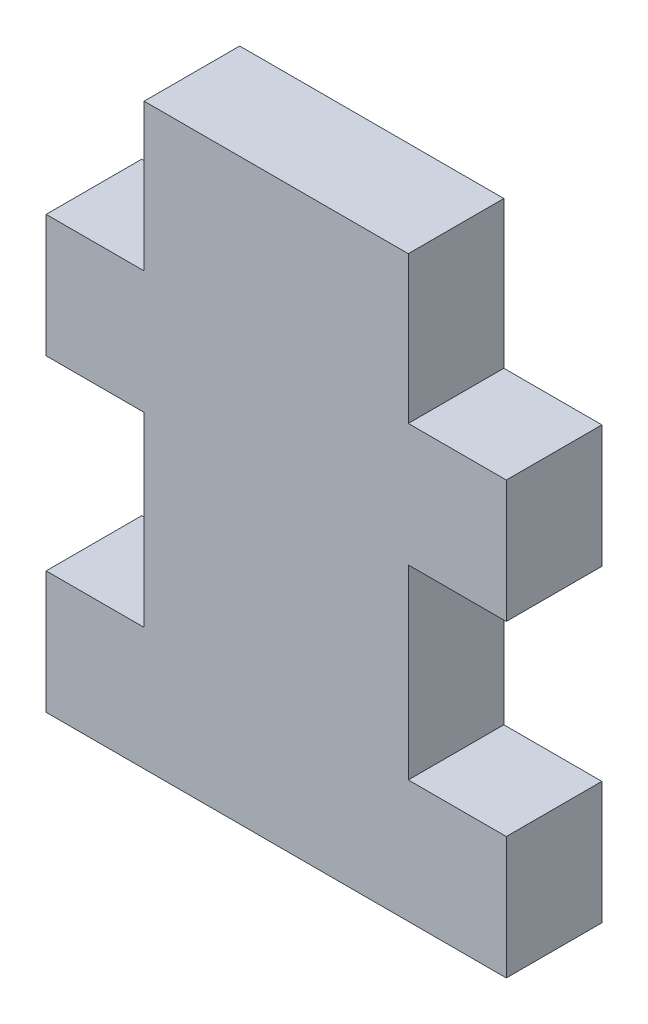
ISO-10303-21;
HEADER;
FILE_DESCRIPTION(('STEP AP214'),'2;1');
FILE_NAME('part.step','',(''),(''),'','','');
FILE_SCHEMA(('AUTOMOTIVE_DESIGN { 1 0 10303 214 1 1 1 1 }'));
ENDSEC;
DATA;
#1=APPLICATION_CONTEXT('core data for automotive mechanical design processes');
#2=APPLICATION_PROTOCOL_DEFINITION('international standard','automotive_design',2000,#1);
#3=PRODUCT_CONTEXT('',#1,'mechanical');
#4=PRODUCT('Part','Part','',(#3));
#5=PRODUCT_RELATED_PRODUCT_CATEGORY('part','',(#4));
#6=PRODUCT_DEFINITION_FORMATION('','',#4);
#7=PRODUCT_DEFINITION_CONTEXT('part definition',#1,'design');
#8=PRODUCT_DEFINITION('design','',#6,#7);
#9=PRODUCT_DEFINITION_SHAPE('','',#8);
#10=(LENGTH_UNIT() NAMED_UNIT(*) SI_UNIT(.MILLI.,.METRE.));
#11=(NAMED_UNIT(*) PLANE_ANGLE_UNIT() SI_UNIT($,.RADIAN.));
#12=(NAMED_UNIT(*) SI_UNIT($,.STERADIAN.) SOLID_ANGLE_UNIT());
#13=UNCERTAINTY_MEASURE_WITH_UNIT(LENGTH_MEASURE(1.E-05),#10,'distance_accuracy_value','');
#14=(GEOMETRIC_REPRESENTATION_CONTEXT(3) GLOBAL_UNCERTAINTY_ASSIGNED_CONTEXT((#13)) GLOBAL_UNIT_ASSIGNED_CONTEXT((#10,
#11,#12)) REPRESENTATION_CONTEXT('',''));
#15=CARTESIAN_POINT('',(0.,0.,0.));
#16=DIRECTION('',(0.,0.,1.));
#17=DIRECTION('',(1.,0.,0.));
#18=AXIS2_PLACEMENT_3D('',#15,#16,#17);
#19=CARTESIAN_POINT('',(6.84529999999999,76.835,2.4765));
#20=DIRECTION('',(-1.,0.,0.));
#21=DIRECTION('',(0.,-1.,0.));
#22=AXIS2_PLACEMENT_3D('',#19,#20,#21);
#23=PLANE('',#22);
#24=DIRECTION('',(0.,1.,0.));
#25=VECTOR('',#24,1.);
#26=CARTESIAN_POINT('',(6.84529999999999,76.835,-2.4765));
#27=LINE('',#26,#25);
#28=CARTESIAN_POINT('',(6.84529999999999,76.835,-2.4765));
#29=VERTEX_POINT('',#28);
#30=CARTESIAN_POINT('',(6.84529999999999,84.455,-2.4765));
#31=VERTEX_POINT('',#30);
#32=EDGE_CURVE('E177',#29,#31,#27,.T.);
#33=ORIENTED_EDGE('',*,*,#32,.T.);
#34=DIRECTION('',(0.,0.,-1.));
#35=VECTOR('',#34,1.);
#36=CARTESIAN_POINT('',(6.84529999999999,84.455,2.4765));
#37=LINE('',#36,#35);
#38=CARTESIAN_POINT('',(6.84529999999999,84.455,2.4765));
#39=VERTEX_POINT('',#38);
#40=EDGE_CURVE('E11',#39,#31,#37,.T.);
#41=ORIENTED_EDGE('',*,*,#40,.F.);
#42=DIRECTION('',(0.,1.,0.));
#43=VECTOR('',#42,1.);
#44=CARTESIAN_POINT('',(6.84529999999999,76.835,2.4765));
#45=LINE('',#44,#43);
#46=CARTESIAN_POINT('',(6.84529999999999,76.835,2.4765));
#47=VERTEX_POINT('',#46);
#48=EDGE_CURVE('E207',#47,#39,#45,.T.);
#49=ORIENTED_EDGE('',*,*,#48,.F.);
#50=DIRECTION('',(0.,0.,-1.));
#51=VECTOR('',#50,1.);
#52=CARTESIAN_POINT('',(6.84529999999999,76.835,2.4765));
#53=LINE('',#52,#51);
#54=EDGE_CURVE('E173',#47,#29,#53,.T.);
#55=ORIENTED_EDGE('',*,*,#54,.T.);
#56=EDGE_LOOP('',(#33,#41,#49,#55));
#57=FACE_BOUND('',#56,.T.);
#58=ADVANCED_FACE('F33',(#57),#23,.F.);
#59=CARTESIAN_POINT('',(6.84529999999999,84.455,2.4765));
#60=DIRECTION('',(0.,-1.,0.));
#61=DIRECTION('',(0.,0.,-1.));
#62=AXIS2_PLACEMENT_3D('',#59,#60,#61);
#63=PLANE('',#62);
#64=DIRECTION('',(-1.,0.,0.));
#65=VECTOR('',#64,1.);
#66=CARTESIAN_POINT('',(6.84529999999999,84.455,-2.4765));
#67=LINE('',#66,#65);
#68=CARTESIAN_POINT('',(-6.84530000000001,84.455,-2.4765));
#69=VERTEX_POINT('',#68);
#70=EDGE_CURVE('E180',#31,#69,#67,.T.);
#71=ORIENTED_EDGE('',*,*,#70,.T.);
#72=DIRECTION('',(0.,0.,-1.));
#73=VECTOR('',#72,1.);
#74=CARTESIAN_POINT('',(-6.84530000000001,84.455,2.4765));
#75=LINE('',#74,#73);
#76=CARTESIAN_POINT('',(-6.84530000000001,84.455,2.4765));
#77=VERTEX_POINT('',#76);
#78=EDGE_CURVE('E41',#77,#69,#75,.T.);
#79=ORIENTED_EDGE('',*,*,#78,.F.);
#80=DIRECTION('',(-1.,0.,0.));
#81=VECTOR('',#80,1.);
#82=CARTESIAN_POINT('',(6.84529999999999,84.455,2.4765));
#83=LINE('',#82,#81);
#84=EDGE_CURVE('E116',#39,#77,#83,.T.);
#85=ORIENTED_EDGE('',*,*,#84,.F.);
#86=ORIENTED_EDGE('',*,*,#40,.T.);
#87=EDGE_LOOP('',(#71,#79,#85,#86));
#88=FACE_BOUND('',#87,.T.);
#89=ADVANCED_FACE('F305',(#88),#63,.F.);
#90=CARTESIAN_POINT('',(-6.84530000000001,76.835,2.4765));
#91=DIRECTION('',(1.,0.,0.));
#92=DIRECTION('',(0.,1.,0.));
#93=AXIS2_PLACEMENT_3D('',#90,#91,#92);
#94=PLANE('',#93);
#95=DIRECTION('',(0.,-1.,0.));
#96=VECTOR('',#95,1.);
#97=CARTESIAN_POINT('',(-6.84530000000001,76.835,-2.4765));
#98=LINE('',#97,#96);
#99=CARTESIAN_POINT('',(-6.84530000000001,76.835,-2.4765));
#100=VERTEX_POINT('',#99);
#101=EDGE_CURVE('E182',#69,#100,#98,.T.);
#102=ORIENTED_EDGE('',*,*,#101,.T.);
#103=DIRECTION('',(0.,0.,-1.));
#104=VECTOR('',#103,1.);
#105=CARTESIAN_POINT('',(-6.84530000000001,76.835,2.4765));
#106=LINE('',#105,#104);
#107=CARTESIAN_POINT('',(-6.84530000000001,76.835,2.4765));
#108=VERTEX_POINT('',#107);
#109=EDGE_CURVE('E238',#108,#100,#106,.T.);
#110=ORIENTED_EDGE('',*,*,#109,.F.);
#111=DIRECTION('',(0.,-1.,0.));
#112=VECTOR('',#111,1.);
#113=CARTESIAN_POINT('',(-6.84530000000001,76.835,2.4765));
#114=LINE('',#113,#112);
#115=EDGE_CURVE('E246',#77,#108,#114,.T.);
#116=ORIENTED_EDGE('',*,*,#115,.F.);
#117=ORIENTED_EDGE('',*,*,#78,.T.);
#118=EDGE_LOOP('',(#102,#110,#116,#117));
#119=FACE_BOUND('',#118,.T.);
#120=ADVANCED_FACE('F244',(#119),#94,.F.);
#121=CARTESIAN_POINT('',(-6.84530000000001,76.835,2.4765));
#122=DIRECTION('',(0.,-1.,0.));
#123=DIRECTION('',(0.,0.,-1.));
#124=AXIS2_PLACEMENT_3D('',#121,#122,#123);
#125=PLANE('',#124);
#126=DIRECTION('',(-1.,0.,0.));
#127=VECTOR('',#126,1.);
#128=CARTESIAN_POINT('',(-6.84530000000001,76.835,-2.4765));
#129=LINE('',#128,#127);
#130=CARTESIAN_POINT('',(-11.9253,76.835,-2.4765));
#131=VERTEX_POINT('',#130);
#132=EDGE_CURVE('E184',#100,#131,#129,.T.);
#133=ORIENTED_EDGE('',*,*,#132,.T.);
#134=DIRECTION('',(0.,0.,-1.));
#135=VECTOR('',#134,1.);
#136=CARTESIAN_POINT('',(-11.9253,76.835,2.4765));
#137=LINE('',#136,#135);
#138=CARTESIAN_POINT('',(-11.9253,76.835,2.4765));
#139=VERTEX_POINT('',#138);
#140=EDGE_CURVE('E235',#139,#131,#137,.T.);
#141=ORIENTED_EDGE('',*,*,#140,.F.);
#142=DIRECTION('',(-1.,0.,0.));
#143=VECTOR('',#142,1.);
#144=CARTESIAN_POINT('',(-6.84530000000001,76.835,2.4765));
#145=LINE('',#144,#143);
#146=EDGE_CURVE('E264',#108,#139,#145,.T.);
#147=ORIENTED_EDGE('',*,*,#146,.F.);
#148=ORIENTED_EDGE('',*,*,#109,.T.);
#149=EDGE_LOOP('',(#133,#141,#147,#148));
#150=FACE_BOUND('',#149,.T.);
#151=ADVANCED_FACE('F255',(#150),#125,.F.);
#152=CARTESIAN_POINT('',(-11.9253,76.835,2.4765));
#153=DIRECTION('',(1.,0.,0.));
#154=DIRECTION('',(0.,1.,0.));
#155=AXIS2_PLACEMENT_3D('',#152,#153,#154);
#156=PLANE('',#155);
#157=DIRECTION('',(0.,-1.,0.));
#158=VECTOR('',#157,1.);
#159=CARTESIAN_POINT('',(-11.9253,76.835,-2.4765));
#160=LINE('',#159,#158);
#161=CARTESIAN_POINT('',(-11.9253,70.485,-2.4765));
#162=VERTEX_POINT('',#161);
#163=EDGE_CURVE('E186',#131,#162,#160,.T.);
#164=ORIENTED_EDGE('',*,*,#163,.T.);
#165=DIRECTION('',(0.,0.,-1.));
#166=VECTOR('',#165,1.);
#167=CARTESIAN_POINT('',(-11.9253,70.485,2.4765));
#168=LINE('',#167,#166);
#169=CARTESIAN_POINT('',(-11.9253,70.485,2.4765));
#170=VERTEX_POINT('',#169);
#171=EDGE_CURVE('E232',#170,#162,#168,.T.);
#172=ORIENTED_EDGE('',*,*,#171,.F.);
#173=DIRECTION('',(0.,-1.,0.));
#174=VECTOR('',#173,1.);
#175=CARTESIAN_POINT('',(-11.9253,76.835,2.4765));
#176=LINE('',#175,#174);
#177=EDGE_CURVE('E261',#139,#170,#176,.T.);
#178=ORIENTED_EDGE('',*,*,#177,.F.);
#179=ORIENTED_EDGE('',*,*,#140,.T.);
#180=EDGE_LOOP('',(#164,#172,#178,#179));
#181=FACE_BOUND('',#180,.T.);
#182=ADVANCED_FACE('F259',(#181),#156,.F.);
#183=CARTESIAN_POINT('',(-6.84530000000001,70.485,2.4765));
#184=DIRECTION('',(0.,1.,0.));
#185=DIRECTION('',(0.,0.,1.));
#186=AXIS2_PLACEMENT_3D('',#183,#184,#185);
#187=PLANE('',#186);
#188=DIRECTION('',(1.,0.,0.));
#189=VECTOR('',#188,1.);
#190=CARTESIAN_POINT('',(-6.84530000000001,70.485,-2.4765));
#191=LINE('',#190,#189);
#192=CARTESIAN_POINT('',(-6.84530000000001,70.485,-2.4765));
#193=VERTEX_POINT('',#192);
#194=EDGE_CURVE('E188',#162,#193,#191,.T.);
#195=ORIENTED_EDGE('',*,*,#194,.T.);
#196=DIRECTION('',(0.,0.,-1.));
#197=VECTOR('',#196,1.);
#198=CARTESIAN_POINT('',(-6.84530000000001,70.485,2.4765));
#199=LINE('',#198,#197);
#200=CARTESIAN_POINT('',(-6.84530000000001,70.485,2.4765));
#201=VERTEX_POINT('',#200);
#202=EDGE_CURVE('E229',#201,#193,#199,.T.);
#203=ORIENTED_EDGE('',*,*,#202,.F.);
#204=DIRECTION('',(1.,0.,0.));
#205=VECTOR('',#204,1.);
#206=CARTESIAN_POINT('',(-6.84530000000001,70.485,2.4765));
#207=LINE('',#206,#205);
#208=EDGE_CURVE('E263',#170,#201,#207,.T.);
#209=ORIENTED_EDGE('',*,*,#208,.F.);
#210=ORIENTED_EDGE('',*,*,#171,.T.);
#211=EDGE_LOOP('',(#195,#203,#209,#210));
#212=FACE_BOUND('',#211,.T.);
#213=ADVANCED_FACE('F318',(#212),#187,.F.);
#214=CARTESIAN_POINT('',(-6.8453,60.833,2.4765));
#215=DIRECTION('',(1.,0.,0.));
#216=DIRECTION('',(0.,1.,0.));
#217=AXIS2_PLACEMENT_3D('',#214,#215,#216);
#218=PLANE('',#217);
#219=DIRECTION('',(0.,-1.,0.));
#220=VECTOR('',#219,1.);
#221=CARTESIAN_POINT('',(-6.8453,60.833,-2.4765));
#222=LINE('',#221,#220);
#223=CARTESIAN_POINT('',(-6.8453,60.833,-2.4765));
#224=VERTEX_POINT('',#223);
#225=EDGE_CURVE('E190',#193,#224,#222,.T.);
#226=ORIENTED_EDGE('',*,*,#225,.T.);
#227=DIRECTION('',(0.,0.,-1.));
#228=VECTOR('',#227,1.);
#229=CARTESIAN_POINT('',(-6.8453,60.833,2.4765));
#230=LINE('',#229,#228);
#231=CARTESIAN_POINT('',(-6.8453,60.833,2.4765));
#232=VERTEX_POINT('',#231);
#233=EDGE_CURVE('E226',#232,#224,#230,.T.);
#234=ORIENTED_EDGE('',*,*,#233,.F.);
#235=DIRECTION('',(0.,-1.,0.));
#236=VECTOR('',#235,1.);
#237=CARTESIAN_POINT('',(-6.8453,60.833,2.4765));
#238=LINE('',#237,#236);
#239=EDGE_CURVE('E266',#201,#232,#238,.T.);
#240=ORIENTED_EDGE('',*,*,#239,.F.);
#241=ORIENTED_EDGE('',*,*,#202,.T.);
#242=EDGE_LOOP('',(#226,#234,#240,#241));
#243=FACE_BOUND('',#242,.T.);
#244=ADVANCED_FACE('F321',(#243),#218,.F.);
#245=CARTESIAN_POINT('',(-6.8453,60.833,2.4765));
#246=DIRECTION('',(0.,-1.,0.));
#247=DIRECTION('',(0.,0.,-1.));
#248=AXIS2_PLACEMENT_3D('',#245,#246,#247);
#249=PLANE('',#248);
#250=DIRECTION('',(-1.,0.,0.));
#251=VECTOR('',#250,1.);
#252=CARTESIAN_POINT('',(-6.8453,60.833,-2.4765));
#253=LINE('',#252,#251);
#254=CARTESIAN_POINT('',(-11.9253,60.833,-2.4765));
#255=VERTEX_POINT('',#254);
#256=EDGE_CURVE('E192',#224,#255,#253,.T.);
#257=ORIENTED_EDGE('',*,*,#256,.T.);
#258=DIRECTION('',(0.,0.,-1.));
#259=VECTOR('',#258,1.);
#260=CARTESIAN_POINT('',(-11.9253,60.833,2.4765));
#261=LINE('',#260,#259);
#262=CARTESIAN_POINT('',(-11.9253,60.833,2.4765));
#263=VERTEX_POINT('',#262);
#264=EDGE_CURVE('E223',#263,#255,#261,.T.);
#265=ORIENTED_EDGE('',*,*,#264,.F.);
#266=DIRECTION('',(-1.,0.,0.));
#267=VECTOR('',#266,1.);
#268=CARTESIAN_POINT('',(-6.8453,60.833,2.4765));
#269=LINE('',#268,#267);
#270=EDGE_CURVE('E272',#232,#263,#269,.T.);
#271=ORIENTED_EDGE('',*,*,#270,.F.);
#272=ORIENTED_EDGE('',*,*,#233,.T.);
#273=EDGE_LOOP('',(#257,#265,#271,#272));
#274=FACE_BOUND('',#273,.T.);
#275=ADVANCED_FACE('F325',(#274),#249,.F.);
#276=CARTESIAN_POINT('',(-11.9253,60.833,2.4765));
#277=DIRECTION('',(1.,0.,0.));
#278=DIRECTION('',(0.,0.,-1.));
#279=AXIS2_PLACEMENT_3D('',#276,#277,#278);
#280=PLANE('',#279);
#281=DIRECTION('',(0.,-1.,0.));
#282=VECTOR('',#281,1.);
#283=CARTESIAN_POINT('',(-11.9253,60.833,-2.4765));
#284=LINE('',#283,#282);
#285=CARTESIAN_POINT('',(-11.9253,54.483,-2.4765));
#286=VERTEX_POINT('',#285);
#287=EDGE_CURVE('E194',#255,#286,#284,.T.);
#288=ORIENTED_EDGE('',*,*,#287,.T.);
#289=DIRECTION('',(0.,0.,-1.));
#290=VECTOR('',#289,1.);
#291=CARTESIAN_POINT('',(-11.9253,54.483,2.4765));
#292=LINE('',#291,#290);
#293=CARTESIAN_POINT('',(-11.9253,54.483,2.4765));
#294=VERTEX_POINT('',#293);
#295=EDGE_CURVE('E220',#294,#286,#292,.T.);
#296=ORIENTED_EDGE('',*,*,#295,.F.);
#297=DIRECTION('',(0.,-1.,0.));
#298=VECTOR('',#297,1.);
#299=CARTESIAN_POINT('',(-11.9253,60.833,2.4765));
#300=LINE('',#299,#298);
#301=EDGE_CURVE('E274',#263,#294,#300,.T.);
#302=ORIENTED_EDGE('',*,*,#301,.F.);
#303=ORIENTED_EDGE('',*,*,#264,.T.);
#304=EDGE_LOOP('',(#288,#296,#302,#303));
#305=FACE_BOUND('',#304,.T.);
#306=ADVANCED_FACE('F329',(#305),#280,.F.);
#307=CARTESIAN_POINT('',(11.9253,54.483,2.4765));
#308=DIRECTION('',(0.,1.,0.));
#309=DIRECTION('',(0.,0.,1.));
#310=AXIS2_PLACEMENT_3D('',#307,#308,#309);
#311=PLANE('',#310);
#312=DIRECTION('',(1.,0.,0.));
#313=VECTOR('',#312,1.);
#314=CARTESIAN_POINT('',(11.9253,54.483,-2.4765));
#315=LINE('',#314,#313);
#316=CARTESIAN_POINT('',(11.9253,54.483,-2.4765));
#317=VERTEX_POINT('',#316);
#318=EDGE_CURVE('E196',#286,#317,#315,.T.);
#319=ORIENTED_EDGE('',*,*,#318,.T.);
#320=DIRECTION('',(0.,0.,-1.));
#321=VECTOR('',#320,1.);
#322=CARTESIAN_POINT('',(11.9253,54.483,2.4765));
#323=LINE('',#322,#321);
#324=CARTESIAN_POINT('',(11.9253,54.483,2.4765));
#325=VERTEX_POINT('',#324);
#326=EDGE_CURVE('E217',#325,#317,#323,.T.);
#327=ORIENTED_EDGE('',*,*,#326,.F.);
#328=DIRECTION('',(1.,0.,0.));
#329=VECTOR('',#328,1.);
#330=CARTESIAN_POINT('',(11.9253,54.483,2.4765));
#331=LINE('',#330,#329);
#332=EDGE_CURVE('E276',#294,#325,#331,.T.);
#333=ORIENTED_EDGE('',*,*,#332,.F.);
#334=ORIENTED_EDGE('',*,*,#295,.T.);
#335=EDGE_LOOP('',(#319,#327,#333,#334));
#336=FACE_BOUND('',#335,.T.);
#337=ADVANCED_FACE('F333',(#336),#311,.F.);
#338=CARTESIAN_POINT('',(11.9253,60.833,2.4765));
#339=DIRECTION('',(-1.,0.,0.));
#340=DIRECTION('',(0.,0.,1.));
#341=AXIS2_PLACEMENT_3D('',#338,#339,#340);
#342=PLANE('',#341);
#343=DIRECTION('',(0.,1.,0.));
#344=VECTOR('',#343,1.);
#345=CARTESIAN_POINT('',(11.9253,60.833,-2.4765));
#346=LINE('',#345,#344);
#347=CARTESIAN_POINT('',(11.9253,60.833,-2.4765));
#348=VERTEX_POINT('',#347);
#349=EDGE_CURVE('E198',#317,#348,#346,.T.);
#350=ORIENTED_EDGE('',*,*,#349,.T.);
#351=DIRECTION('',(0.,0.,-1.));
#352=VECTOR('',#351,1.);
#353=CARTESIAN_POINT('',(11.9253,60.833,2.4765));
#354=LINE('',#353,#352);
#355=CARTESIAN_POINT('',(11.9253,60.833,2.4765));
#356=VERTEX_POINT('',#355);
#357=EDGE_CURVE('E214',#356,#348,#354,.T.);
#358=ORIENTED_EDGE('',*,*,#357,.F.);
#359=DIRECTION('',(0.,1.,0.));
#360=VECTOR('',#359,1.);
#361=CARTESIAN_POINT('',(11.9253,60.833,2.4765));
#362=LINE('',#361,#360);
#363=EDGE_CURVE('E278',#325,#356,#362,.T.);
#364=ORIENTED_EDGE('',*,*,#363,.F.);
#365=ORIENTED_EDGE('',*,*,#326,.T.);
#366=EDGE_LOOP('',(#350,#358,#364,#365));
#367=FACE_BOUND('',#366,.T.);
#368=ADVANCED_FACE('F337',(#367),#342,.F.);
#369=CARTESIAN_POINT('',(11.9253,60.833,2.4765));
#370=DIRECTION('',(0.,-1.,0.));
#371=DIRECTION('',(0.,0.,-1.));
#372=AXIS2_PLACEMENT_3D('',#369,#370,#371);
#373=PLANE('',#372);
#374=DIRECTION('',(-1.,0.,0.));
#375=VECTOR('',#374,1.);
#376=CARTESIAN_POINT('',(11.9253,60.833,-2.4765));
#377=LINE('',#376,#375);
#378=CARTESIAN_POINT('',(6.8453,60.833,-2.4765));
#379=VERTEX_POINT('',#378);
#380=EDGE_CURVE('E200',#348,#379,#377,.T.);
#381=ORIENTED_EDGE('',*,*,#380,.T.);
#382=DIRECTION('',(0.,0.,-1.));
#383=VECTOR('',#382,1.);
#384=CARTESIAN_POINT('',(6.8453,60.833,2.4765));
#385=LINE('',#384,#383);
#386=CARTESIAN_POINT('',(6.8453,60.833,2.4765));
#387=VERTEX_POINT('',#386);
#388=EDGE_CURVE('E211',#387,#379,#385,.T.);
#389=ORIENTED_EDGE('',*,*,#388,.F.);
#390=DIRECTION('',(-1.,0.,0.));
#391=VECTOR('',#390,1.);
#392=CARTESIAN_POINT('',(11.9253,60.833,2.4765));
#393=LINE('',#392,#391);
#394=EDGE_CURVE('E280',#356,#387,#393,.T.);
#395=ORIENTED_EDGE('',*,*,#394,.F.);
#396=ORIENTED_EDGE('',*,*,#357,.T.);
#397=EDGE_LOOP('',(#381,#389,#395,#396));
#398=FACE_BOUND('',#397,.T.);
#399=ADVANCED_FACE('F286',(#398),#373,.F.);
#400=CARTESIAN_POINT('',(6.8453,60.833,2.4765));
#401=DIRECTION('',(-1.,0.,0.));
#402=DIRECTION('',(0.,-1.,0.));
#403=AXIS2_PLACEMENT_3D('',#400,#401,#402);
#404=PLANE('',#403);
#405=DIRECTION('',(0.,1.,0.));
#406=VECTOR('',#405,1.);
#407=CARTESIAN_POINT('',(6.8453,60.833,-2.4765));
#408=LINE('',#407,#406);
#409=CARTESIAN_POINT('',(6.8453,70.485,-2.4765));
#410=VERTEX_POINT('',#409);
#411=EDGE_CURVE('E202',#379,#410,#408,.T.);
#412=ORIENTED_EDGE('',*,*,#411,.T.);
#413=DIRECTION('',(0.,0.,-1.));
#414=VECTOR('',#413,1.);
#415=CARTESIAN_POINT('',(6.8453,70.485,2.4765));
#416=LINE('',#415,#414);
#417=CARTESIAN_POINT('',(6.8453,70.485,2.4765));
#418=VERTEX_POINT('',#417);
#419=EDGE_CURVE('E168',#418,#410,#416,.T.);
#420=ORIENTED_EDGE('',*,*,#419,.F.);
#421=DIRECTION('',(0.,1.,0.));
#422=VECTOR('',#421,1.);
#423=CARTESIAN_POINT('',(6.8453,60.833,2.4765));
#424=LINE('',#423,#422);
#425=EDGE_CURVE('E159',#387,#418,#424,.T.);
#426=ORIENTED_EDGE('',*,*,#425,.F.);
#427=ORIENTED_EDGE('',*,*,#388,.T.);
#428=EDGE_LOOP('',(#412,#420,#426,#427));
#429=FACE_BOUND('',#428,.T.);
#430=ADVANCED_FACE('F290',(#429),#404,.F.);
#431=CARTESIAN_POINT('',(11.9253,70.485,2.4765));
#432=DIRECTION('',(0.,1.,0.));
#433=DIRECTION('',(0.,0.,1.));
#434=AXIS2_PLACEMENT_3D('',#431,#432,#433);
#435=PLANE('',#434);
#436=DIRECTION('',(1.,0.,0.));
#437=VECTOR('',#436,1.);
#438=CARTESIAN_POINT('',(11.9253,70.485,-2.4765));
#439=LINE('',#438,#437);
#440=CARTESIAN_POINT('',(11.9253,70.485,-2.4765));
#441=VERTEX_POINT('',#440);
#442=EDGE_CURVE('E167',#410,#441,#439,.T.);
#443=ORIENTED_EDGE('',*,*,#442,.T.);
#444=DIRECTION('',(0.,0.,-1.));
#445=VECTOR('',#444,1.);
#446=CARTESIAN_POINT('',(11.9253,70.485,2.4765));
#447=LINE('',#446,#445);
#448=CARTESIAN_POINT('',(11.9253,70.485,2.4765));
#449=VERTEX_POINT('',#448);
#450=EDGE_CURVE('E164',#449,#441,#447,.T.);
#451=ORIENTED_EDGE('',*,*,#450,.F.);
#452=DIRECTION('',(1.,0.,0.));
#453=VECTOR('',#452,1.);
#454=CARTESIAN_POINT('',(11.9253,70.485,2.4765));
#455=LINE('',#454,#453);
#456=EDGE_CURVE('E153',#418,#449,#455,.T.);
#457=ORIENTED_EDGE('',*,*,#456,.F.);
#458=ORIENTED_EDGE('',*,*,#419,.T.);
#459=EDGE_LOOP('',(#443,#451,#457,#458));
#460=FACE_BOUND('',#459,.T.);
#461=ADVANCED_FACE('F165',(#460),#435,.F.);
#462=CARTESIAN_POINT('',(11.9253,76.835,2.4765));
#463=DIRECTION('',(-1.,0.,0.));
#464=DIRECTION('',(0.,0.,1.));
#465=AXIS2_PLACEMENT_3D('',#462,#463,#464);
#466=PLANE('',#465);
#467=DIRECTION('',(0.,1.,0.));
#468=VECTOR('',#467,1.);
#469=CARTESIAN_POINT('',(11.9253,76.835,-2.4765));
#470=LINE('',#469,#468);
#471=CARTESIAN_POINT('',(11.9253,76.835,-2.4765));
#472=VERTEX_POINT('',#471);
#473=EDGE_CURVE('E102',#441,#472,#470,.T.);
#474=ORIENTED_EDGE('',*,*,#473,.T.);
#475=DIRECTION('',(0.,0.,-1.));
#476=VECTOR('',#475,1.);
#477=CARTESIAN_POINT('',(11.9253,76.835,2.4765));
#478=LINE('',#477,#476);
#479=CARTESIAN_POINT('',(11.9253,76.835,2.4765));
#480=VERTEX_POINT('',#479);
#481=EDGE_CURVE('E169',#480,#472,#478,.T.);
#482=ORIENTED_EDGE('',*,*,#481,.F.);
#483=DIRECTION('',(0.,1.,0.));
#484=VECTOR('',#483,1.);
#485=CARTESIAN_POINT('',(11.9253,76.835,2.4765));
#486=LINE('',#485,#484);
#487=EDGE_CURVE('E157',#449,#480,#486,.T.);
#488=ORIENTED_EDGE('',*,*,#487,.F.);
#489=ORIENTED_EDGE('',*,*,#450,.T.);
#490=EDGE_LOOP('',(#474,#482,#488,#489));
#491=FACE_BOUND('',#490,.T.);
#492=ADVANCED_FACE('F171',(#491),#466,.F.);
#493=CARTESIAN_POINT('',(11.9253,76.835,2.4765));
#494=DIRECTION('',(0.,-1.,0.));
#495=DIRECTION('',(0.,0.,-1.));
#496=AXIS2_PLACEMENT_3D('',#493,#494,#495);
#497=PLANE('',#496);
#498=DIRECTION('',(-1.,0.,0.));
#499=VECTOR('',#498,1.);
#500=CARTESIAN_POINT('',(11.9253,76.835,-2.4765));
#501=LINE('',#500,#499);
#502=EDGE_CURVE('E108',#472,#29,#501,.T.);
#503=ORIENTED_EDGE('',*,*,#502,.T.);
#504=ORIENTED_EDGE('',*,*,#54,.F.);
#505=DIRECTION('',(-1.,0.,0.));
#506=VECTOR('',#505,1.);
#507=CARTESIAN_POINT('',(11.9253,76.835,2.4765));
#508=LINE('',#507,#506);
#509=EDGE_CURVE('E49',#480,#47,#508,.T.);
#510=ORIENTED_EDGE('',*,*,#509,.F.);
#511=ORIENTED_EDGE('',*,*,#481,.T.);
#512=EDGE_LOOP('',(#503,#504,#510,#511));
#513=FACE_BOUND('',#512,.T.);
#514=ADVANCED_FACE('F294',(#513),#497,.F.);
#515=CARTESIAN_POINT('',(0.,0.,2.4765));
#516=DIRECTION('',(0.,0.,1.));
#517=DIRECTION('',(1.,0.,0.));
#518=AXIS2_PLACEMENT_3D('',#515,#516,#517);
#519=PLANE('',#518);
#520=ORIENTED_EDGE('',*,*,#48,.T.);
#521=ORIENTED_EDGE('',*,*,#84,.T.);
#522=ORIENTED_EDGE('',*,*,#115,.T.);
#523=ORIENTED_EDGE('',*,*,#146,.T.);
#524=ORIENTED_EDGE('',*,*,#177,.T.);
#525=ORIENTED_EDGE('',*,*,#208,.T.);
#526=ORIENTED_EDGE('',*,*,#239,.T.);
#527=ORIENTED_EDGE('',*,*,#270,.T.);
#528=ORIENTED_EDGE('',*,*,#301,.T.);
#529=ORIENTED_EDGE('',*,*,#332,.T.);
#530=ORIENTED_EDGE('',*,*,#363,.T.);
#531=ORIENTED_EDGE('',*,*,#394,.T.);
#532=ORIENTED_EDGE('',*,*,#425,.T.);
#533=ORIENTED_EDGE('',*,*,#456,.T.);
#534=ORIENTED_EDGE('',*,*,#487,.T.);
#535=ORIENTED_EDGE('',*,*,#509,.T.);
#536=EDGE_LOOP('',(#520,#521,#522,#523,#524,#525,#526,#527,#528,#529,#530,#531,#532,#533,#534,#535));
#537=FACE_BOUND('',#536,.T.);
#538=ADVANCED_FACE('F155',(#537),#519,.T.);
#539=CARTESIAN_POINT('',(0.,0.,-2.4765));
#540=DIRECTION('',(0.,0.,1.));
#541=DIRECTION('',(1.,0.,0.));
#542=AXIS2_PLACEMENT_3D('',#539,#540,#541);
#543=PLANE('',#542);
#544=ORIENTED_EDGE('',*,*,#32,.F.);
#545=ORIENTED_EDGE('',*,*,#502,.F.);
#546=ORIENTED_EDGE('',*,*,#473,.F.);
#547=ORIENTED_EDGE('',*,*,#442,.F.);
#548=ORIENTED_EDGE('',*,*,#411,.F.);
#549=ORIENTED_EDGE('',*,*,#380,.F.);
#550=ORIENTED_EDGE('',*,*,#349,.F.);
#551=ORIENTED_EDGE('',*,*,#318,.F.);
#552=ORIENTED_EDGE('',*,*,#287,.F.);
#553=ORIENTED_EDGE('',*,*,#256,.F.);
#554=ORIENTED_EDGE('',*,*,#225,.F.);
#555=ORIENTED_EDGE('',*,*,#194,.F.);
#556=ORIENTED_EDGE('',*,*,#163,.F.);
#557=ORIENTED_EDGE('',*,*,#132,.F.);
#558=ORIENTED_EDGE('',*,*,#101,.F.);
#559=ORIENTED_EDGE('',*,*,#70,.F.);
#560=EDGE_LOOP('',(#544,#545,#546,#547,#548,#549,#550,#551,#552,#553,#554,#555,#556,#557,#558,#559));
#561=FACE_BOUND('',#560,.T.);
#562=ADVANCED_FACE('F250',(#561),#543,.F.);
#563=CLOSED_SHELL('',(#58,#89,#120,#151,#182,#213,#244,#275,#306,#337,#368,#399,#430,#461,#492,
#514,#538,#562));
#564=MANIFOLD_SOLID_BREP('B2',#563);
#565=ADVANCED_BREP_SHAPE_REPRESENTATION('',(#18,#564),#14);
#566=SHAPE_DEFINITION_REPRESENTATION(#9,#565);
ENDSEC;
END-ISO-10303-21;
